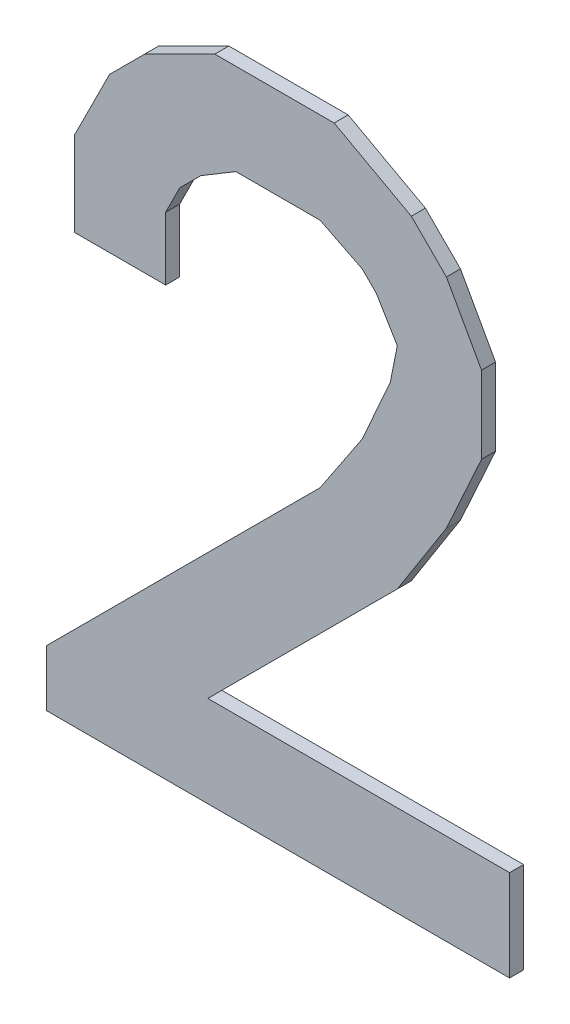
ISO-10303-21;
HEADER;
FILE_DESCRIPTION(('STEP AP214'),'2;1');
FILE_NAME('part.step','',(''),(''),'','','');
FILE_SCHEMA(('AUTOMOTIVE_DESIGN { 1 0 10303 214 1 1 1 1 }'));
ENDSEC;
DATA;
#1=APPLICATION_CONTEXT('core data for automotive mechanical design processes');
#2=APPLICATION_PROTOCOL_DEFINITION('international standard','automotive_design',2000,#1);
#3=PRODUCT_CONTEXT('',#1,'mechanical');
#4=PRODUCT('Part','Part','',(#3));
#5=PRODUCT_RELATED_PRODUCT_CATEGORY('part','',(#4));
#6=PRODUCT_DEFINITION_FORMATION('','',#4);
#7=PRODUCT_DEFINITION_CONTEXT('part definition',#1,'design');
#8=PRODUCT_DEFINITION('design','',#6,#7);
#9=PRODUCT_DEFINITION_SHAPE('','',#8);
#10=(LENGTH_UNIT() NAMED_UNIT(*) SI_UNIT(.MILLI.,.METRE.));
#11=(NAMED_UNIT(*) PLANE_ANGLE_UNIT() SI_UNIT($,.RADIAN.));
#12=(NAMED_UNIT(*) SI_UNIT($,.STERADIAN.) SOLID_ANGLE_UNIT());
#13=UNCERTAINTY_MEASURE_WITH_UNIT(LENGTH_MEASURE(1.E-05),#10,'distance_accuracy_value','');
#14=(GEOMETRIC_REPRESENTATION_CONTEXT(3) GLOBAL_UNCERTAINTY_ASSIGNED_CONTEXT((#13)) GLOBAL_UNIT_ASSIGNED_CONTEXT((#10,
#11,#12)) REPRESENTATION_CONTEXT('',''));
#15=CARTESIAN_POINT('',(0.,0.,0.));
#16=DIRECTION('',(0.,0.,1.));
#17=DIRECTION('',(1.,0.,0.));
#18=AXIS2_PLACEMENT_3D('',#15,#16,#17);
#19=CARTESIAN_POINT('',(-0.28999942,0.14500098,0.));
#20=DIRECTION('',(0.,0.,-1.));
#21=DIRECTION('',(0.,-1.,0.));
#22=AXIS2_PLACEMENT_3D('',#19,#20,#21);
#23=PLANE('',#22);
#24=DIRECTION('',(0.,-1.,0.));
#25=VECTOR('',#24,1.);
#26=CARTESIAN_POINT('',(-0.15999968,0.14500098,0.));
#27=LINE('',#26,#25);
#28=CARTESIAN_POINT('',(-0.15999968,0.2350008,0.));
#29=VERTEX_POINT('',#28);
#30=CARTESIAN_POINT('',(-0.15999968,0.14500098,0.));
#31=VERTEX_POINT('',#30);
#32=EDGE_CURVE('E27',#29,#31,#27,.T.);
#33=ORIENTED_EDGE('',*,*,#32,.T.);
#34=DIRECTION('',(-1.,0.,0.));
#35=VECTOR('',#34,1.);
#36=CARTESIAN_POINT('',(-0.28999942,0.14500098,0.));
#37=LINE('',#36,#35);
#38=CARTESIAN_POINT('',(-0.28999942,0.14500098,0.));
#39=VERTEX_POINT('',#38);
#40=EDGE_CURVE('E11',#31,#39,#37,.T.);
#41=ORIENTED_EDGE('',*,*,#40,.T.);
#42=DIRECTION('',(0.,1.,0.));
#43=VECTOR('',#42,1.);
#44=CARTESIAN_POINT('',(-0.28999942,0.14500098,0.));
#45=LINE('',#44,#43);
#46=CARTESIAN_POINT('',(-0.28999942,0.26500074,0.));
#47=VERTEX_POINT('',#46);
#48=EDGE_CURVE('E389',#39,#47,#45,.T.);
#49=ORIENTED_EDGE('',*,*,#48,.T.);
#50=DIRECTION('',(0.447213595499958,0.894427190999916,0.));
#51=VECTOR('',#50,1.);
#52=CARTESIAN_POINT('',(-0.28999942,0.26500074,0.));
#53=LINE('',#52,#51);
#54=CARTESIAN_POINT('',(-0.23999952,0.36500054,0.));
#55=VERTEX_POINT('',#54);
#56=EDGE_CURVE('E400',#47,#55,#53,.T.);
#57=ORIENTED_EDGE('',*,*,#56,.T.);
#58=DIRECTION('',(0.707106781186548,0.707106781186548,0.));
#59=VECTOR('',#58,1.);
#60=CARTESIAN_POINT('',(-0.23999952,0.36500054,0.));
#61=LINE('',#60,#59);
#62=CARTESIAN_POINT('',(-0.18999962,0.41500044,0.));
#63=VERTEX_POINT('',#62);
#64=EDGE_CURVE('E399',#55,#63,#61,.T.);
#65=ORIENTED_EDGE('',*,*,#64,.T.);
#66=DIRECTION('',(0.894427190999916,0.447213595499958,0.));
#67=VECTOR('',#66,1.);
#68=CARTESIAN_POINT('',(-0.18999962,0.41500044,0.));
#69=LINE('',#68,#67);
#70=CARTESIAN_POINT('',(-0.08999982,0.46500034,0.));
#71=VERTEX_POINT('',#70);
#72=EDGE_CURVE('E365',#63,#71,#69,.T.);
#73=ORIENTED_EDGE('',*,*,#72,.T.);
#74=DIRECTION('',(1.,0.,0.));
#75=VECTOR('',#74,1.);
#76=CARTESIAN_POINT('',(-0.28999942,0.46500034,0.));
#77=LINE('',#76,#75);
#78=CARTESIAN_POINT('',(0.07999984000001,0.46500034,0.));
#79=VERTEX_POINT('',#78);
#80=EDGE_CURVE('E431',#71,#79,#77,.T.);
#81=ORIENTED_EDGE('',*,*,#80,.T.);
#82=DIRECTION('',(0.877895572914117,-0.478852130681064,0.));
#83=VECTOR('',#82,1.);
#84=CARTESIAN_POINT('',(0.07999984,0.46500034,0.));
#85=LINE('',#84,#83);
#86=CARTESIAN_POINT('',(0.18999962,0.40500046,0.));
#87=VERTEX_POINT('',#86);
#88=EDGE_CURVE('E439',#79,#87,#85,.T.);
#89=ORIENTED_EDGE('',*,*,#88,.T.);
#90=DIRECTION('',(0.707106781186548,-0.707106781186548,0.));
#91=VECTOR('',#90,1.);
#92=CARTESIAN_POINT('',(0.18999962,0.40500046,0.));
#93=LINE('',#92,#91);
#94=CARTESIAN_POINT('',(0.23999952,0.35500056,0.));
#95=VERTEX_POINT('',#94);
#96=EDGE_CURVE('E424',#87,#95,#93,.T.);
#97=ORIENTED_EDGE('',*,*,#96,.T.);
#98=DIRECTION('',(0.485642931178717,-0.874157276121491,0.));
#99=VECTOR('',#98,1.);
#100=CARTESIAN_POINT('',(0.23999952,0.35500056,0.));
#101=LINE('',#100,#99);
#102=CARTESIAN_POINT('',(0.28999942,0.26500074,0.));
#103=VERTEX_POINT('',#102);
#104=EDGE_CURVE('E423',#95,#103,#101,.T.);
#105=ORIENTED_EDGE('',*,*,#104,.T.);
#106=DIRECTION('',(0.,-1.,0.));
#107=VECTOR('',#106,1.);
#108=CARTESIAN_POINT('',(0.28999942,0.14500098,0.));
#109=LINE('',#108,#107);
#110=CARTESIAN_POINT('',(0.28999942,0.15500096,0.));
#111=VERTEX_POINT('',#110);
#112=EDGE_CURVE('E456',#103,#111,#109,.T.);
#113=ORIENTED_EDGE('',*,*,#112,.T.);
#114=DIRECTION('',(-0.413802944300882,-0.910366477462742,0.));
#115=VECTOR('',#114,1.);
#116=CARTESIAN_POINT('',(0.28999942,0.15500096,0.));
#117=LINE('',#116,#115);
#118=CARTESIAN_POINT('',(0.23999952,0.04500118,0.));
#119=VERTEX_POINT('',#118);
#120=EDGE_CURVE('E461',#111,#119,#117,.T.);
#121=ORIENTED_EDGE('',*,*,#120,.T.);
#122=DIRECTION('',(-0.536875492193095,-0.843661487732149,0.));
#123=VECTOR('',#122,1.);
#124=CARTESIAN_POINT('',(0.23999952,0.04500118,0.));
#125=LINE('',#124,#123);
#126=CARTESIAN_POINT('',(0.16999966,-0.06499860000001,0.));
#127=VERTEX_POINT('',#126);
#128=EDGE_CURVE('E475',#119,#127,#125,.T.);
#129=ORIENTED_EDGE('',*,*,#128,.T.);
#130=DIRECTION('',(-0.707106781186548,-0.707106781186548,0.));
#131=VECTOR('',#130,1.);
#132=CARTESIAN_POINT('',(0.16999966,-0.06499860000001,0.));
#133=LINE('',#132,#131);
#134=CARTESIAN_POINT('',(-0.09999980000001,-0.33499806,0.));
#135=VERTEX_POINT('',#134);
#136=EDGE_CURVE('E476',#127,#135,#133,.T.);
#137=ORIENTED_EDGE('',*,*,#136,.T.);
#138=DIRECTION('',(1.,0.,0.));
#139=VECTOR('',#138,1.);
#140=CARTESIAN_POINT('',(-0.28999942,-0.33499806,0.));
#141=LINE('',#140,#139);
#142=CARTESIAN_POINT('',(0.32999934,-0.33499806,0.));
#143=VERTEX_POINT('',#142);
#144=EDGE_CURVE('E482',#135,#143,#141,.T.);
#145=ORIENTED_EDGE('',*,*,#144,.T.);
#146=DIRECTION('',(0.,-1.,0.));
#147=VECTOR('',#146,1.);
#148=CARTESIAN_POINT('',(0.32999934,0.14500098,0.));
#149=LINE('',#148,#147);
#150=CARTESIAN_POINT('',(0.32999934,-0.4649978,0.));
#151=VERTEX_POINT('',#150);
#152=EDGE_CURVE('E490',#143,#151,#149,.T.);
#153=ORIENTED_EDGE('',*,*,#152,.T.);
#154=DIRECTION('',(-1.,0.,0.));
#155=VECTOR('',#154,1.);
#156=CARTESIAN_POINT('',(-0.28999942,-0.4649978,0.));
#157=LINE('',#156,#155);
#158=CARTESIAN_POINT('',(-0.32999934,-0.4649978,0.));
#159=VERTEX_POINT('',#158);
#160=EDGE_CURVE('E495',#151,#159,#157,.T.);
#161=ORIENTED_EDGE('',*,*,#160,.T.);
#162=DIRECTION('',(0.,1.,0.));
#163=VECTOR('',#162,1.);
#164=CARTESIAN_POINT('',(-0.32999934,0.14500098,0.));
#165=LINE('',#164,#163);
#166=CARTESIAN_POINT('',(-0.32999934,-0.38499796,0.));
#167=VERTEX_POINT('',#166);
#168=EDGE_CURVE('E285',#159,#167,#165,.T.);
#169=ORIENTED_EDGE('',*,*,#168,.T.);
#170=DIRECTION('',(0.707106781186548,0.707106781186548,0.));
#171=VECTOR('',#170,1.);
#172=CARTESIAN_POINT('',(-0.32999934,-0.38499796,0.));
#173=LINE('',#172,#171);
#174=CARTESIAN_POINT('',(0.05999988,0.005001259999995,0.));
#175=VERTEX_POINT('',#174);
#176=EDGE_CURVE('E284',#167,#175,#173,.T.);
#177=ORIENTED_EDGE('',*,*,#176,.T.);
#178=DIRECTION('',(0.554700196224998,0.832050294337998,0.));
#179=VECTOR('',#178,1.);
#180=CARTESIAN_POINT('',(0.05999987999999,0.00500126,0.));
#181=LINE('',#180,#179);
#182=CARTESIAN_POINT('',(0.11999976,0.09500108,0.));
#183=VERTEX_POINT('',#182);
#184=EDGE_CURVE('E280',#175,#183,#181,.T.);
#185=ORIENTED_EDGE('',*,*,#184,.T.);
#186=DIRECTION('',(0.40613846605317,0.913811548620381,0.));
#187=VECTOR('',#186,1.);
#188=CARTESIAN_POINT('',(0.11999976,0.09500108,0.));
#189=LINE('',#188,#187);
#190=CARTESIAN_POINT('',(0.15999968,0.1850009,0.));
#191=VERTEX_POINT('',#190);
#192=EDGE_CURVE('E418',#183,#191,#189,.T.);
#193=ORIENTED_EDGE('',*,*,#192,.T.);
#194=DIRECTION('',(0.196116135137992,0.980580675690959,0.));
#195=VECTOR('',#194,1.);
#196=CARTESIAN_POINT('',(0.15999968,0.1850009,0.));
#197=LINE('',#196,#195);
#198=CARTESIAN_POINT('',(0.16999966,0.2350008,0.));
#199=VERTEX_POINT('',#198);
#200=EDGE_CURVE('E508',#191,#199,#197,.T.);
#201=ORIENTED_EDGE('',*,*,#200,.T.);
#202=DIRECTION('',(-0.514495755427674,0.857492925712456,0.));
#203=VECTOR('',#202,1.);
#204=CARTESIAN_POINT('',(0.16999966,0.2350008,0.));
#205=LINE('',#204,#203);
#206=CARTESIAN_POINT('',(0.13999972,0.2850007,0.));
#207=VERTEX_POINT('',#206);
#208=EDGE_CURVE('E507',#199,#207,#205,.T.);
#209=ORIENTED_EDGE('',*,*,#208,.T.);
#210=DIRECTION('',(-0.707106781186548,0.707106781186548,0.));
#211=VECTOR('',#210,1.);
#212=CARTESIAN_POINT('',(0.13999972,0.2850007,0.));
#213=LINE('',#212,#211);
#214=CARTESIAN_POINT('',(0.11999976,0.30500066,0.));
#215=VERTEX_POINT('',#214);
#216=EDGE_CURVE('E462',#207,#215,#213,.T.);
#217=ORIENTED_EDGE('',*,*,#216,.T.);
#218=DIRECTION('',(-0.894427190999916,0.447213595499958,0.));
#219=VECTOR('',#218,1.);
#220=CARTESIAN_POINT('',(0.11999976,0.30500066,0.));
#221=LINE('',#220,#219);
#222=CARTESIAN_POINT('',(0.05999987999999,0.3350006,0.));
#223=VERTEX_POINT('',#222);
#224=EDGE_CURVE('E524',#215,#223,#221,.T.);
#225=ORIENTED_EDGE('',*,*,#224,.T.);
#226=DIRECTION('',(-1.,0.,0.));
#227=VECTOR('',#226,1.);
#228=CARTESIAN_POINT('',(-0.28999942,0.3350006,0.));
#229=LINE('',#228,#227);
#230=CARTESIAN_POINT('',(-0.05999988000001,0.3350006,0.));
#231=VERTEX_POINT('',#230);
#232=EDGE_CURVE('E377',#223,#231,#229,.T.);
#233=ORIENTED_EDGE('',*,*,#232,.T.);
#234=DIRECTION('',(-0.857492925712191,-0.514495755428115,0.));
#235=VECTOR('',#234,1.);
#236=CARTESIAN_POINT('',(-0.05999988000001,0.3350006,0.));
#237=LINE('',#236,#235);
#238=CARTESIAN_POINT('',(-0.10999978,0.30500066,0.));
#239=VERTEX_POINT('',#238);
#240=EDGE_CURVE('E533',#231,#239,#237,.T.);
#241=ORIENTED_EDGE('',*,*,#240,.T.);
#242=DIRECTION('',(-0.707106781186548,-0.707106781186548,0.));
#243=VECTOR('',#242,1.);
#244=CARTESIAN_POINT('',(-0.10999978,0.30500066,0.));
#245=LINE('',#244,#243);
#246=CARTESIAN_POINT('',(-0.13999972,0.27500072,0.));
#247=VERTEX_POINT('',#246);
#248=EDGE_CURVE('E542',#239,#247,#245,.T.);
#249=ORIENTED_EDGE('',*,*,#248,.T.);
#250=DIRECTION('',(-0.447213595499958,-0.894427190999916,0.));
#251=VECTOR('',#250,1.);
#252=CARTESIAN_POINT('',(-0.13999972,0.27500072,0.));
#253=LINE('',#252,#251);
#254=EDGE_CURVE('E390',#247,#29,#253,.T.);
#255=ORIENTED_EDGE('',*,*,#254,.T.);
#256=EDGE_LOOP('',(#33,#41,#49,#57,#65,#73,#81,#89,#97,#105,#113,#121,#129,#137,#145,#153,#161,
#169,#177,#185,#193,#201,#209,#217,#225,#233,#241,#249,#255));
#257=FACE_BOUND('',#256,.T.);
#258=ADVANCED_FACE('F17',(#257),#23,.T.);
#259=CARTESIAN_POINT('',(-0.28999942,0.14500098,0.));
#260=DIRECTION('',(0.,1.,0.));
#261=DIRECTION('',(1.,0.,0.));
#262=AXIS2_PLACEMENT_3D('',#259,#260,#261);
#263=PLANE('',#262);
#264=DIRECTION('',(0.,0.,-1.));
#265=VECTOR('',#264,1.);
#266=CARTESIAN_POINT('',(-0.15999968,0.14500098,0.));
#267=LINE('',#266,#265);
#268=CARTESIAN_POINT('',(-0.15999968,0.14500098,0.02));
#269=VERTEX_POINT('',#268);
#270=EDGE_CURVE('E393',#269,#31,#267,.T.);
#271=ORIENTED_EDGE('',*,*,#270,.F.);
#272=DIRECTION('',(1.,0.,0.));
#273=VECTOR('',#272,1.);
#274=CARTESIAN_POINT('',(-0.28999942,0.14500098,0.02));
#275=LINE('',#274,#273);
#276=CARTESIAN_POINT('',(-0.28999942,0.14500098,0.02));
#277=VERTEX_POINT('',#276);
#278=EDGE_CURVE('E343',#277,#269,#275,.T.);
#279=ORIENTED_EDGE('',*,*,#278,.F.);
#280=DIRECTION('',(0.,0.,1.));
#281=VECTOR('',#280,1.);
#282=CARTESIAN_POINT('',(-0.28999942,0.14500098,0.));
#283=LINE('',#282,#281);
#284=EDGE_CURVE('E347',#39,#277,#283,.T.);
#285=ORIENTED_EDGE('',*,*,#284,.F.);
#286=ORIENTED_EDGE('',*,*,#40,.F.);
#287=EDGE_LOOP('',(#271,#279,#285,#286));
#288=FACE_BOUND('',#287,.T.);
#289=ADVANCED_FACE('F19',(#288),#263,.F.);
#290=CARTESIAN_POINT('',(-0.15999968,0.14500098,0.));
#291=DIRECTION('',(-1.,0.,0.));
#292=DIRECTION('',(0.,0.,1.));
#293=AXIS2_PLACEMENT_3D('',#290,#291,#292);
#294=PLANE('',#293);
#295=DIRECTION('',(0.,0.,-1.));
#296=VECTOR('',#295,1.);
#297=CARTESIAN_POINT('',(-0.15999968,0.2350008,0.));
#298=LINE('',#297,#296);
#299=CARTESIAN_POINT('',(-0.15999968,0.2350008,0.02));
#300=VERTEX_POINT('',#299);
#301=EDGE_CURVE('E394',#300,#29,#298,.T.);
#302=ORIENTED_EDGE('',*,*,#301,.F.);
#303=DIRECTION('',(0.,1.,0.));
#304=VECTOR('',#303,1.);
#305=CARTESIAN_POINT('',(-0.15999968,0.14500098,0.02));
#306=LINE('',#305,#304);
#307=EDGE_CURVE('E620',#269,#300,#306,.T.);
#308=ORIENTED_EDGE('',*,*,#307,.F.);
#309=ORIENTED_EDGE('',*,*,#270,.T.);
#310=ORIENTED_EDGE('',*,*,#32,.F.);
#311=EDGE_LOOP('',(#302,#308,#309,#310));
#312=FACE_BOUND('',#311,.T.);
#313=ADVANCED_FACE('F1086',(#312),#294,.F.);
#314=CARTESIAN_POINT('',(-0.15999968,0.2350008,0.));
#315=DIRECTION('',(-0.894427190999916,0.447213595499958,0.));
#316=DIRECTION('',(0.,0.,1.));
#317=AXIS2_PLACEMENT_3D('',#314,#315,#316);
#318=PLANE('',#317);
#319=DIRECTION('',(0.,0.,-1.));
#320=VECTOR('',#319,1.);
#321=CARTESIAN_POINT('',(-0.13999972,0.27500072,0.));
#322=LINE('',#321,#320);
#323=CARTESIAN_POINT('',(-0.13999972,0.27500072,0.02));
#324=VERTEX_POINT('',#323);
#325=EDGE_CURVE('E21',#324,#247,#322,.T.);
#326=ORIENTED_EDGE('',*,*,#325,.F.);
#327=DIRECTION('',(0.447213595499958,0.894427190999916,0.));
#328=VECTOR('',#327,1.);
#329=CARTESIAN_POINT('',(-0.15999968,0.2350008,0.02));
#330=LINE('',#329,#328);
#331=EDGE_CURVE('E610',#300,#324,#330,.T.);
#332=ORIENTED_EDGE('',*,*,#331,.F.);
#333=ORIENTED_EDGE('',*,*,#301,.T.);
#334=ORIENTED_EDGE('',*,*,#254,.F.);
#335=EDGE_LOOP('',(#326,#332,#333,#334));
#336=FACE_BOUND('',#335,.T.);
#337=ADVANCED_FACE('F921',(#336),#318,.F.);
#338=CARTESIAN_POINT('',(-0.13999972,0.27500072,0.));
#339=DIRECTION('',(-0.707106781186548,0.707106781186548,0.));
#340=DIRECTION('',(0.,0.,1.));
#341=AXIS2_PLACEMENT_3D('',#338,#339,#340);
#342=PLANE('',#341);
#343=DIRECTION('',(0.,0.,-1.));
#344=VECTOR('',#343,1.);
#345=CARTESIAN_POINT('',(-0.10999978,0.30500066,0.));
#346=LINE('',#345,#344);
#347=CARTESIAN_POINT('',(-0.10999978,0.30500066,0.02));
#348=VERTEX_POINT('',#347);
#349=EDGE_CURVE('E381',#348,#239,#346,.T.);
#350=ORIENTED_EDGE('',*,*,#349,.F.);
#351=DIRECTION('',(0.707106781186548,0.707106781186548,0.));
#352=VECTOR('',#351,1.);
#353=CARTESIAN_POINT('',(-0.13999972,0.27500072,0.02));
#354=LINE('',#353,#352);
#355=EDGE_CURVE('E596',#324,#348,#354,.T.);
#356=ORIENTED_EDGE('',*,*,#355,.F.);
#357=ORIENTED_EDGE('',*,*,#325,.T.);
#358=ORIENTED_EDGE('',*,*,#248,.F.);
#359=EDGE_LOOP('',(#350,#356,#357,#358));
#360=FACE_BOUND('',#359,.T.);
#361=ADVANCED_FACE('F915',(#360),#342,.F.);
#362=CARTESIAN_POINT('',(-0.10999978,0.30500066,0.));
#363=DIRECTION('',(-0.514495755428115,0.857492925712191,0.));
#364=DIRECTION('',(0.,0.,1.));
#365=AXIS2_PLACEMENT_3D('',#362,#363,#364);
#366=PLANE('',#365);
#367=DIRECTION('',(0.,0.,-1.));
#368=VECTOR('',#367,1.);
#369=CARTESIAN_POINT('',(-0.05999988000003,0.3350006,0.));
#370=LINE('',#369,#368);
#371=CARTESIAN_POINT('',(-0.05999988000001,0.3350006,0.02));
#372=VERTEX_POINT('',#371);
#373=EDGE_CURVE('E382',#372,#231,#370,.T.);
#374=ORIENTED_EDGE('',*,*,#373,.F.);
#375=DIRECTION('',(0.857492925712191,0.514495755428115,0.));
#376=VECTOR('',#375,1.);
#377=CARTESIAN_POINT('',(-0.10999978,0.30500066,0.02));
#378=LINE('',#377,#376);
#379=EDGE_CURVE('E583',#348,#372,#378,.T.);
#380=ORIENTED_EDGE('',*,*,#379,.F.);
#381=ORIENTED_EDGE('',*,*,#349,.T.);
#382=ORIENTED_EDGE('',*,*,#240,.F.);
#383=EDGE_LOOP('',(#374,#380,#381,#382));
#384=FACE_BOUND('',#383,.T.);
#385=ADVANCED_FACE('F920',(#384),#366,.F.);
#386=CARTESIAN_POINT('',(-0.05999988000001,0.3350006,0.));
#387=DIRECTION('',(0.,1.,0.));
#388=DIRECTION('',(1.,0.,0.));
#389=AXIS2_PLACEMENT_3D('',#386,#387,#388);
#390=PLANE('',#389);
#391=DIRECTION('',(0.,0.,-1.));
#392=VECTOR('',#391,1.);
#393=CARTESIAN_POINT('',(0.05999987999999,0.3350006,0.));
#394=LINE('',#393,#392);
#395=CARTESIAN_POINT('',(0.05999987999999,0.3350006,0.02));
#396=VERTEX_POINT('',#395);
#397=EDGE_CURVE('E466',#396,#223,#394,.T.);
#398=ORIENTED_EDGE('',*,*,#397,.F.);
#399=DIRECTION('',(1.,0.,0.));
#400=VECTOR('',#399,1.);
#401=CARTESIAN_POINT('',(-0.05999988000001,0.3350006,0.02));
#402=LINE('',#401,#400);
#403=EDGE_CURVE('E578',#372,#396,#402,.T.);
#404=ORIENTED_EDGE('',*,*,#403,.F.);
#405=ORIENTED_EDGE('',*,*,#373,.T.);
#406=ORIENTED_EDGE('',*,*,#232,.F.);
#407=EDGE_LOOP('',(#398,#404,#405,#406));
#408=FACE_BOUND('',#407,.T.);
#409=ADVANCED_FACE('F976',(#408),#390,.F.);
#410=CARTESIAN_POINT('',(0.05999987999999,0.3350006,0.));
#411=DIRECTION('',(0.447213595499958,0.894427190999916,0.));
#412=DIRECTION('',(0.,0.,-1.));
#413=AXIS2_PLACEMENT_3D('',#410,#411,#412);
#414=PLANE('',#413);
#415=DIRECTION('',(0.,0.,-1.));
#416=VECTOR('',#415,1.);
#417=CARTESIAN_POINT('',(0.11999976,0.30500066,0.));
#418=LINE('',#417,#416);
#419=CARTESIAN_POINT('',(0.11999976,0.30500066,0.02));
#420=VERTEX_POINT('',#419);
#421=EDGE_CURVE('E467',#420,#215,#418,.T.);
#422=ORIENTED_EDGE('',*,*,#421,.F.);
#423=DIRECTION('',(0.894427190999916,-0.447213595499958,0.));
#424=VECTOR('',#423,1.);
#425=CARTESIAN_POINT('',(0.05999987999999,0.3350006,0.02));
#426=LINE('',#425,#424);
#427=EDGE_CURVE('E582',#396,#420,#426,.T.);
#428=ORIENTED_EDGE('',*,*,#427,.F.);
#429=ORIENTED_EDGE('',*,*,#397,.T.);
#430=ORIENTED_EDGE('',*,*,#224,.F.);
#431=EDGE_LOOP('',(#422,#428,#429,#430));
#432=FACE_BOUND('',#431,.T.);
#433=ADVANCED_FACE('F981',(#432),#414,.F.);
#434=CARTESIAN_POINT('',(0.11999976,0.30500066,0.));
#435=DIRECTION('',(0.707106781186548,0.707106781186548,0.));
#436=DIRECTION('',(0.,0.,-1.));
#437=AXIS2_PLACEMENT_3D('',#434,#435,#436);
#438=PLANE('',#437);
#439=DIRECTION('',(0.,0.,-1.));
#440=VECTOR('',#439,1.);
#441=CARTESIAN_POINT('',(0.13999972,0.2850007,0.));
#442=LINE('',#441,#440);
#443=CARTESIAN_POINT('',(0.13999972,0.2850007,0.02));
#444=VERTEX_POINT('',#443);
#445=EDGE_CURVE('E503',#444,#207,#442,.T.);
#446=ORIENTED_EDGE('',*,*,#445,.F.);
#447=DIRECTION('',(0.707106781186548,-0.707106781186548,0.));
#448=VECTOR('',#447,1.);
#449=CARTESIAN_POINT('',(0.11999976,0.30500066,0.02));
#450=LINE('',#449,#448);
#451=EDGE_CURVE('E571',#420,#444,#450,.T.);
#452=ORIENTED_EDGE('',*,*,#451,.F.);
#453=ORIENTED_EDGE('',*,*,#421,.T.);
#454=ORIENTED_EDGE('',*,*,#216,.F.);
#455=EDGE_LOOP('',(#446,#452,#453,#454));
#456=FACE_BOUND('',#455,.T.);
#457=ADVANCED_FACE('F631',(#456),#438,.F.);
#458=CARTESIAN_POINT('',(0.13999972,0.2850007,0.));
#459=DIRECTION('',(0.857492925712897,0.514495755426938,0.));
#460=DIRECTION('',(0.,0.,-1.));
#461=AXIS2_PLACEMENT_3D('',#458,#459,#460);
#462=PLANE('',#461);
#463=DIRECTION('',(0.,0.,-1.));
#464=VECTOR('',#463,1.);
#465=CARTESIAN_POINT('',(0.16999966,0.2350008,0.));
#466=LINE('',#465,#464);
#467=CARTESIAN_POINT('',(0.16999966,0.2350008,0.02));
#468=VERTEX_POINT('',#467);
#469=EDGE_CURVE('E514',#468,#199,#466,.T.);
#470=ORIENTED_EDGE('',*,*,#469,.F.);
#471=DIRECTION('',(0.514495755426938,-0.857492925712897,0.));
#472=VECTOR('',#471,1.);
#473=CARTESIAN_POINT('',(0.13999972,0.2850007,0.02));
#474=LINE('',#473,#472);
#475=EDGE_CURVE('E556',#444,#468,#474,.T.);
#476=ORIENTED_EDGE('',*,*,#475,.F.);
#477=ORIENTED_EDGE('',*,*,#445,.T.);
#478=ORIENTED_EDGE('',*,*,#208,.F.);
#479=EDGE_LOOP('',(#470,#476,#477,#478));
#480=FACE_BOUND('',#479,.T.);
#481=ADVANCED_FACE('F633',(#480),#462,.F.);
#482=CARTESIAN_POINT('',(0.16999966,0.2350008,0.));
#483=DIRECTION('',(0.980580675690959,-0.196116135137992,0.));
#484=DIRECTION('',(0.,0.,-1.));
#485=AXIS2_PLACEMENT_3D('',#482,#483,#484);
#486=PLANE('',#485);
#487=DIRECTION('',(0.,0.,-1.));
#488=VECTOR('',#487,1.);
#489=CARTESIAN_POINT('',(0.15999968,0.1850009,0.));
#490=LINE('',#489,#488);
#491=CARTESIAN_POINT('',(0.15999968,0.1850009,0.02));
#492=VERTEX_POINT('',#491);
#493=EDGE_CURVE('E414',#492,#191,#490,.T.);
#494=ORIENTED_EDGE('',*,*,#493,.F.);
#495=DIRECTION('',(-0.196116135137992,-0.980580675690959,0.));
#496=VECTOR('',#495,1.);
#497=CARTESIAN_POINT('',(0.16999966,0.2350008,0.02));
#498=LINE('',#497,#496);
#499=EDGE_CURVE('E309',#468,#492,#498,.T.);
#500=ORIENTED_EDGE('',*,*,#499,.F.);
#501=ORIENTED_EDGE('',*,*,#469,.T.);
#502=ORIENTED_EDGE('',*,*,#200,.F.);
#503=EDGE_LOOP('',(#494,#500,#501,#502));
#504=FACE_BOUND('',#503,.T.);
#505=ADVANCED_FACE('F636',(#504),#486,.F.);
#506=CARTESIAN_POINT('',(0.15999968,0.1850009,0.));
#507=DIRECTION('',(0.913811548620381,-0.40613846605317,0.));
#508=DIRECTION('',(0.,0.,-1.));
#509=AXIS2_PLACEMENT_3D('',#506,#507,#508);
#510=PLANE('',#509);
#511=DIRECTION('',(0.,0.,-1.));
#512=VECTOR('',#511,1.);
#513=CARTESIAN_POINT('',(0.11999976,0.09500107999999,0.));
#514=LINE('',#513,#512);
#515=CARTESIAN_POINT('',(0.11999976,0.09500108,0.02));
#516=VERTEX_POINT('',#515);
#517=EDGE_CURVE('E320',#516,#183,#514,.T.);
#518=ORIENTED_EDGE('',*,*,#517,.F.);
#519=DIRECTION('',(-0.40613846605317,-0.913811548620381,0.));
#520=VECTOR('',#519,1.);
#521=CARTESIAN_POINT('',(0.15999968,0.1850009,0.02));
#522=LINE('',#521,#520);
#523=EDGE_CURVE('E302',#492,#516,#522,.T.);
#524=ORIENTED_EDGE('',*,*,#523,.F.);
#525=ORIENTED_EDGE('',*,*,#493,.T.);
#526=ORIENTED_EDGE('',*,*,#192,.F.);
#527=EDGE_LOOP('',(#518,#524,#525,#526));
#528=FACE_BOUND('',#527,.T.);
#529=ADVANCED_FACE('F638',(#528),#510,.F.);
#530=CARTESIAN_POINT('',(0.11999976,0.09500108,0.));
#531=DIRECTION('',(0.832050294337998,-0.554700196224998,0.));
#532=DIRECTION('',(0.,0.,-1.));
#533=AXIS2_PLACEMENT_3D('',#530,#531,#532);
#534=PLANE('',#533);
#535=DIRECTION('',(0.,0.,-1.));
#536=VECTOR('',#535,1.);
#537=CARTESIAN_POINT('',(0.05999988000002,0.005001259999979,0.));
#538=LINE('',#537,#536);
#539=CARTESIAN_POINT('',(0.05999988,0.005001259999995,0.02));
#540=VERTEX_POINT('',#539);
#541=EDGE_CURVE('E272',#540,#175,#538,.T.);
#542=ORIENTED_EDGE('',*,*,#541,.F.);
#543=DIRECTION('',(-0.554700196224998,-0.832050294337998,0.));
#544=VECTOR('',#543,1.);
#545=CARTESIAN_POINT('',(0.11999976,0.09500108,0.02));
#546=LINE('',#545,#544);
#547=EDGE_CURVE('E277',#516,#540,#546,.T.);
#548=ORIENTED_EDGE('',*,*,#547,.F.);
#549=ORIENTED_EDGE('',*,*,#517,.T.);
#550=ORIENTED_EDGE('',*,*,#184,.F.);
#551=EDGE_LOOP('',(#542,#548,#549,#550));
#552=FACE_BOUND('',#551,.T.);
#553=ADVANCED_FACE('F274',(#552),#534,.F.);
#554=CARTESIAN_POINT('',(0.05999987999999,0.00500126,0.));
#555=DIRECTION('',(0.707106781186548,-0.707106781186548,0.));
#556=DIRECTION('',(0.,0.,-1.));
#557=AXIS2_PLACEMENT_3D('',#554,#555,#556);
#558=PLANE('',#557);
#559=DIRECTION('',(0.,0.,-1.));
#560=VECTOR('',#559,1.);
#561=CARTESIAN_POINT('',(-0.32999934,-0.38499796,0.));
#562=LINE('',#561,#560);
#563=CARTESIAN_POINT('',(-0.32999934,-0.38499796,0.02));
#564=VERTEX_POINT('',#563);
#565=EDGE_CURVE('E291',#564,#167,#562,.T.);
#566=ORIENTED_EDGE('',*,*,#565,.F.);
#567=DIRECTION('',(-0.707106781186548,-0.707106781186548,0.));
#568=VECTOR('',#567,1.);
#569=CARTESIAN_POINT('',(0.05999987999999,0.00500126,0.02));
#570=LINE('',#569,#568);
#571=EDGE_CURVE('E288',#540,#564,#570,.T.);
#572=ORIENTED_EDGE('',*,*,#571,.F.);
#573=ORIENTED_EDGE('',*,*,#541,.T.);
#574=ORIENTED_EDGE('',*,*,#176,.F.);
#575=EDGE_LOOP('',(#566,#572,#573,#574));
#576=FACE_BOUND('',#575,.T.);
#577=ADVANCED_FACE('F289',(#576),#558,.F.);
#578=CARTESIAN_POINT('',(-0.32999934,-0.38499796,0.));
#579=DIRECTION('',(1.,0.,0.));
#580=DIRECTION('',(0.,1.,0.));
#581=AXIS2_PLACEMENT_3D('',#578,#579,#580);
#582=PLANE('',#581);
#583=DIRECTION('',(0.,0.,-1.));
#584=VECTOR('',#583,1.);
#585=CARTESIAN_POINT('',(-0.32999934,-0.4649978,0.));
#586=LINE('',#585,#584);
#587=CARTESIAN_POINT('',(-0.32999934,-0.4649978,0.02));
#588=VERTEX_POINT('',#587);
#589=EDGE_CURVE('E491',#588,#159,#586,.T.);
#590=ORIENTED_EDGE('',*,*,#589,.F.);
#591=DIRECTION('',(0.,-1.,0.));
#592=VECTOR('',#591,1.);
#593=CARTESIAN_POINT('',(-0.32999934,-0.38499796,0.02));
#594=LINE('',#593,#592);
#595=EDGE_CURVE('E296',#564,#588,#594,.T.);
#596=ORIENTED_EDGE('',*,*,#595,.F.);
#597=ORIENTED_EDGE('',*,*,#565,.T.);
#598=ORIENTED_EDGE('',*,*,#168,.F.);
#599=EDGE_LOOP('',(#590,#596,#597,#598));
#600=FACE_BOUND('',#599,.T.);
#601=ADVANCED_FACE('F640',(#600),#582,.F.);
#602=CARTESIAN_POINT('',(-0.32999934,-0.4649978,0.));
#603=DIRECTION('',(0.,1.,0.));
#604=DIRECTION('',(1.,0.,0.));
#605=AXIS2_PLACEMENT_3D('',#602,#603,#604);
#606=PLANE('',#605);
#607=DIRECTION('',(0.,0.,-1.));
#608=VECTOR('',#607,1.);
#609=CARTESIAN_POINT('',(0.32999934,-0.4649978,0.));
#610=LINE('',#609,#608);
#611=CARTESIAN_POINT('',(0.32999934,-0.4649978,0.02));
#612=VERTEX_POINT('',#611);
#613=EDGE_CURVE('E486',#612,#151,#610,.T.);
#614=ORIENTED_EDGE('',*,*,#613,.F.);
#615=DIRECTION('',(1.,0.,0.));
#616=VECTOR('',#615,1.);
#617=CARTESIAN_POINT('',(-0.32999934,-0.4649978,0.02));
#618=LINE('',#617,#616);
#619=EDGE_CURVE('E564',#588,#612,#618,.T.);
#620=ORIENTED_EDGE('',*,*,#619,.F.);
#621=ORIENTED_EDGE('',*,*,#589,.T.);
#622=ORIENTED_EDGE('',*,*,#160,.F.);
#623=EDGE_LOOP('',(#614,#620,#621,#622));
#624=FACE_BOUND('',#623,.T.);
#625=ADVANCED_FACE('F645',(#624),#606,.F.);
#626=CARTESIAN_POINT('',(0.32999934,-0.4649978,0.));
#627=DIRECTION('',(-1.,0.,0.));
#628=DIRECTION('',(0.,0.,1.));
#629=AXIS2_PLACEMENT_3D('',#626,#627,#628);
#630=PLANE('',#629);
#631=DIRECTION('',(0.,0.,-1.));
#632=VECTOR('',#631,1.);
#633=CARTESIAN_POINT('',(0.32999934,-0.33499806,0.));
#634=LINE('',#633,#632);
#635=CARTESIAN_POINT('',(0.32999934,-0.33499806,0.02));
#636=VERTEX_POINT('',#635);
#637=EDGE_CURVE('E480',#636,#143,#634,.T.);
#638=ORIENTED_EDGE('',*,*,#637,.F.);
#639=DIRECTION('',(0.,1.,0.));
#640=VECTOR('',#639,1.);
#641=CARTESIAN_POINT('',(0.32999934,-0.4649978,0.02));
#642=LINE('',#641,#640);
#643=EDGE_CURVE('E560',#612,#636,#642,.T.);
#644=ORIENTED_EDGE('',*,*,#643,.F.);
#645=ORIENTED_EDGE('',*,*,#613,.T.);
#646=ORIENTED_EDGE('',*,*,#152,.F.);
#647=EDGE_LOOP('',(#638,#644,#645,#646));
#648=FACE_BOUND('',#647,.T.);
#649=ADVANCED_FACE('F647',(#648),#630,.F.);
#650=CARTESIAN_POINT('',(0.32999934,-0.33499806,0.));
#651=DIRECTION('',(0.,-1.,0.));
#652=DIRECTION('',(0.,0.,-1.));
#653=AXIS2_PLACEMENT_3D('',#650,#651,#652);
#654=PLANE('',#653);
#655=DIRECTION('',(0.,0.,-1.));
#656=VECTOR('',#655,1.);
#657=CARTESIAN_POINT('',(-0.09999980000001,-0.33499806,0.));
#658=LINE('',#657,#656);
#659=CARTESIAN_POINT('',(-0.09999980000001,-0.33499806,0.02));
#660=VERTEX_POINT('',#659);
#661=EDGE_CURVE('E481',#660,#135,#658,.T.);
#662=ORIENTED_EDGE('',*,*,#661,.F.);
#663=DIRECTION('',(-1.,0.,0.));
#664=VECTOR('',#663,1.);
#665=CARTESIAN_POINT('',(0.32999934,-0.33499806,0.02));
#666=LINE('',#665,#664);
#667=EDGE_CURVE('E312',#636,#660,#666,.T.);
#668=ORIENTED_EDGE('',*,*,#667,.F.);
#669=ORIENTED_EDGE('',*,*,#637,.T.);
#670=ORIENTED_EDGE('',*,*,#144,.F.);
#671=EDGE_LOOP('',(#662,#668,#669,#670));
#672=FACE_BOUND('',#671,.T.);
#673=ADVANCED_FACE('F650',(#672),#654,.F.);
#674=CARTESIAN_POINT('',(-0.09999980000001,-0.33499806,0.));
#675=DIRECTION('',(-0.707106781186548,0.707106781186548,0.));
#676=DIRECTION('',(0.,0.,1.));
#677=AXIS2_PLACEMENT_3D('',#674,#675,#676);
#678=PLANE('',#677);
#679=DIRECTION('',(0.,0.,-1.));
#680=VECTOR('',#679,1.);
#681=CARTESIAN_POINT('',(0.16999966,-0.0649986,0.));
#682=LINE('',#681,#680);
#683=CARTESIAN_POINT('',(0.16999966,-0.06499860000001,0.02));
#684=VERTEX_POINT('',#683);
#685=EDGE_CURVE('E471',#684,#127,#682,.T.);
#686=ORIENTED_EDGE('',*,*,#685,.F.);
#687=DIRECTION('',(0.707106781186548,0.707106781186548,0.));
#688=VECTOR('',#687,1.);
#689=CARTESIAN_POINT('',(-0.09999980000001,-0.33499806,0.02));
#690=LINE('',#689,#688);
#691=EDGE_CURVE('E315',#660,#684,#690,.T.);
#692=ORIENTED_EDGE('',*,*,#691,.F.);
#693=ORIENTED_EDGE('',*,*,#661,.T.);
#694=ORIENTED_EDGE('',*,*,#136,.F.);
#695=EDGE_LOOP('',(#686,#692,#693,#694));
#696=FACE_BOUND('',#695,.T.);
#697=ADVANCED_FACE('F963',(#696),#678,.F.);
#698=CARTESIAN_POINT('',(0.16999966,-0.06499860000001,0.));
#699=DIRECTION('',(-0.843661487732149,0.536875492193095,0.));
#700=DIRECTION('',(0.,0.,1.));
#701=AXIS2_PLACEMENT_3D('',#698,#699,#700);
#702=PLANE('',#701);
#703=DIRECTION('',(0.,0.,-1.));
#704=VECTOR('',#703,1.);
#705=CARTESIAN_POINT('',(0.23999952,0.04500118,0.));
#706=LINE('',#705,#704);
#707=CARTESIAN_POINT('',(0.23999952,0.04500118,0.02));
#708=VERTEX_POINT('',#707);
#709=EDGE_CURVE('E457',#708,#119,#706,.T.);
#710=ORIENTED_EDGE('',*,*,#709,.F.);
#711=DIRECTION('',(0.536875492193095,0.843661487732149,0.));
#712=VECTOR('',#711,1.);
#713=CARTESIAN_POINT('',(0.16999966,-0.06499860000001,0.02));
#714=LINE('',#713,#712);
#715=EDGE_CURVE('E319',#684,#708,#714,.T.);
#716=ORIENTED_EDGE('',*,*,#715,.F.);
#717=ORIENTED_EDGE('',*,*,#685,.T.);
#718=ORIENTED_EDGE('',*,*,#128,.F.);
#719=EDGE_LOOP('',(#710,#716,#717,#718));
#720=FACE_BOUND('',#719,.T.);
#721=ADVANCED_FACE('F890',(#720),#702,.F.);
#722=CARTESIAN_POINT('',(0.23999952,0.04500118,0.));
#723=DIRECTION('',(-0.910366477462742,0.413802944300882,0.));
#724=DIRECTION('',(0.,0.,1.));
#725=AXIS2_PLACEMENT_3D('',#722,#723,#724);
#726=PLANE('',#725);
#727=DIRECTION('',(0.,0.,-1.));
#728=VECTOR('',#727,1.);
#729=CARTESIAN_POINT('',(0.28999942,0.15500096,0.));
#730=LINE('',#729,#728);
#731=CARTESIAN_POINT('',(0.28999942,0.15500096,0.02));
#732=VERTEX_POINT('',#731);
#733=EDGE_CURVE('E450',#732,#111,#730,.T.);
#734=ORIENTED_EDGE('',*,*,#733,.F.);
#735=DIRECTION('',(0.413802944300882,0.910366477462742,0.));
#736=VECTOR('',#735,1.);
#737=CARTESIAN_POINT('',(0.23999952,0.04500118,0.02));
#738=LINE('',#737,#736);
#739=EDGE_CURVE('E326',#708,#732,#738,.T.);
#740=ORIENTED_EDGE('',*,*,#739,.F.);
#741=ORIENTED_EDGE('',*,*,#709,.T.);
#742=ORIENTED_EDGE('',*,*,#120,.F.);
#743=EDGE_LOOP('',(#734,#740,#741,#742));
#744=FACE_BOUND('',#743,.T.);
#745=ADVANCED_FACE('F884',(#744),#726,.F.);
#746=CARTESIAN_POINT('',(0.28999942,0.15500096,0.));
#747=DIRECTION('',(-1.,0.,0.));
#748=DIRECTION('',(0.,0.,1.));
#749=AXIS2_PLACEMENT_3D('',#746,#747,#748);
#750=PLANE('',#749);
#751=DIRECTION('',(0.,0.,-1.));
#752=VECTOR('',#751,1.);
#753=CARTESIAN_POINT('',(0.28999942,0.26500074,0.));
#754=LINE('',#753,#752);
#755=CARTESIAN_POINT('',(0.28999942,0.26500074,0.02));
#756=VERTEX_POINT('',#755);
#757=EDGE_CURVE('E419',#756,#103,#754,.T.);
#758=ORIENTED_EDGE('',*,*,#757,.F.);
#759=DIRECTION('',(0.,1.,0.));
#760=VECTOR('',#759,1.);
#761=CARTESIAN_POINT('',(0.28999942,0.15500096,0.02));
#762=LINE('',#761,#760);
#763=EDGE_CURVE('E330',#732,#756,#762,.T.);
#764=ORIENTED_EDGE('',*,*,#763,.F.);
#765=ORIENTED_EDGE('',*,*,#733,.T.);
#766=ORIENTED_EDGE('',*,*,#112,.F.);
#767=EDGE_LOOP('',(#758,#764,#765,#766));
#768=FACE_BOUND('',#767,.T.);
#769=ADVANCED_FACE('F889',(#768),#750,.F.);
#770=CARTESIAN_POINT('',(0.28999942,0.26500074,0.));
#771=DIRECTION('',(-0.874157276121255,-0.485642931179142,0.));
#772=DIRECTION('',(-0.485642931179142,0.874157276121255,0.));
#773=AXIS2_PLACEMENT_3D('',#770,#771,#772);
#774=PLANE('',#773);
#775=DIRECTION('',(0.,0.,-1.));
#776=VECTOR('',#775,1.);
#777=CARTESIAN_POINT('',(0.23999952,0.35500056,0.));
#778=LINE('',#777,#776);
#779=CARTESIAN_POINT('',(0.23999952,0.35500056,0.02));
#780=VERTEX_POINT('',#779);
#781=EDGE_CURVE('E440',#780,#95,#778,.T.);
#782=ORIENTED_EDGE('',*,*,#781,.F.);
#783=DIRECTION('',(-0.485642931179142,0.874157276121255,0.));
#784=VECTOR('',#783,1.);
#785=CARTESIAN_POINT('',(0.28999942,0.26500074,0.02));
#786=LINE('',#785,#784);
#787=EDGE_CURVE('E334',#756,#780,#786,.T.);
#788=ORIENTED_EDGE('',*,*,#787,.F.);
#789=ORIENTED_EDGE('',*,*,#757,.T.);
#790=ORIENTED_EDGE('',*,*,#104,.F.);
#791=EDGE_LOOP('',(#782,#788,#789,#790));
#792=FACE_BOUND('',#791,.T.);
#793=ADVANCED_FACE('F900',(#792),#774,.F.);
#794=CARTESIAN_POINT('',(0.23999952,0.35500056,0.));
#795=DIRECTION('',(-0.707106781186548,-0.707106781186548,0.));
#796=DIRECTION('',(-0.707106781186548,0.707106781186548,0.));
#797=AXIS2_PLACEMENT_3D('',#794,#795,#796);
#798=PLANE('',#797);
#799=DIRECTION('',(0.,0.,-1.));
#800=VECTOR('',#799,1.);
#801=CARTESIAN_POINT('',(0.18999962,0.40500046,0.));
#802=LINE('',#801,#800);
#803=CARTESIAN_POINT('',(0.18999962,0.40500046,0.02));
#804=VERTEX_POINT('',#803);
#805=EDGE_CURVE('E434',#804,#87,#802,.T.);
#806=ORIENTED_EDGE('',*,*,#805,.F.);
#807=DIRECTION('',(-0.707106781186548,0.707106781186548,0.));
#808=VECTOR('',#807,1.);
#809=CARTESIAN_POINT('',(0.23999952,0.35500056,0.02));
#810=LINE('',#809,#808);
#811=EDGE_CURVE('E338',#780,#804,#810,.T.);
#812=ORIENTED_EDGE('',*,*,#811,.F.);
#813=ORIENTED_EDGE('',*,*,#781,.T.);
#814=ORIENTED_EDGE('',*,*,#96,.F.);
#815=EDGE_LOOP('',(#806,#812,#813,#814));
#816=FACE_BOUND('',#815,.T.);
#817=ADVANCED_FACE('F953',(#816),#798,.F.);
#818=CARTESIAN_POINT('',(0.18999962,0.40500046,0.));
#819=DIRECTION('',(-0.478852130681064,-0.877895572914117,0.));
#820=DIRECTION('',(-0.877895572914117,0.478852130681064,0.));
#821=AXIS2_PLACEMENT_3D('',#818,#819,#820);
#822=PLANE('',#821);
#823=DIRECTION('',(0.,0.,-1.));
#824=VECTOR('',#823,1.);
#825=CARTESIAN_POINT('',(0.07999984000003,0.46500034,0.));
#826=LINE('',#825,#824);
#827=CARTESIAN_POINT('',(0.07999984000001,0.46500034,0.02));
#828=VERTEX_POINT('',#827);
#829=EDGE_CURVE('E369',#828,#79,#826,.T.);
#830=ORIENTED_EDGE('',*,*,#829,.F.);
#831=DIRECTION('',(-0.877895572914117,0.478852130681064,0.));
#832=VECTOR('',#831,1.);
#833=CARTESIAN_POINT('',(0.18999962,0.40500046,0.02));
#834=LINE('',#833,#832);
#835=EDGE_CURVE('E342',#804,#828,#834,.T.);
#836=ORIENTED_EDGE('',*,*,#835,.F.);
#837=ORIENTED_EDGE('',*,*,#805,.T.);
#838=ORIENTED_EDGE('',*,*,#88,.F.);
#839=EDGE_LOOP('',(#830,#836,#837,#838));
#840=FACE_BOUND('',#839,.T.);
#841=ADVANCED_FACE('F877',(#840),#822,.F.);
#842=CARTESIAN_POINT('',(0.07999984,0.46500034,0.));
#843=DIRECTION('',(0.,-1.,0.));
#844=DIRECTION('',(0.,0.,-1.));
#845=AXIS2_PLACEMENT_3D('',#842,#843,#844);
#846=PLANE('',#845);
#847=DIRECTION('',(0.,0.,-1.));
#848=VECTOR('',#847,1.);
#849=CARTESIAN_POINT('',(-0.08999982,0.46500034,0.));
#850=LINE('',#849,#848);
#851=CARTESIAN_POINT('',(-0.08999982,0.46500034,0.02));
#852=VERTEX_POINT('',#851);
#853=EDGE_CURVE('E370',#852,#71,#850,.T.);
#854=ORIENTED_EDGE('',*,*,#853,.F.);
#855=DIRECTION('',(-1.,0.,0.));
#856=VECTOR('',#855,1.);
#857=CARTESIAN_POINT('',(0.07999984,0.46500034,0.02));
#858=LINE('',#857,#856);
#859=EDGE_CURVE('E352',#828,#852,#858,.T.);
#860=ORIENTED_EDGE('',*,*,#859,.F.);
#861=ORIENTED_EDGE('',*,*,#829,.T.);
#862=ORIENTED_EDGE('',*,*,#80,.F.);
#863=EDGE_LOOP('',(#854,#860,#861,#862));
#864=FACE_BOUND('',#863,.T.);
#865=ADVANCED_FACE('F871',(#864),#846,.F.);
#866=CARTESIAN_POINT('',(-0.08999982,0.46500034,0.));
#867=DIRECTION('',(0.447213595499958,-0.894427190999916,0.));
#868=DIRECTION('',(0.,0.,-1.));
#869=AXIS2_PLACEMENT_3D('',#866,#867,#868);
#870=PLANE('',#869);
#871=DIRECTION('',(0.,0.,-1.));
#872=VECTOR('',#871,1.);
#873=CARTESIAN_POINT('',(-0.18999962,0.41500044,0.));
#874=LINE('',#873,#872);
#875=CARTESIAN_POINT('',(-0.18999962,0.41500044,0.02));
#876=VERTEX_POINT('',#875);
#877=EDGE_CURVE('E395',#876,#63,#874,.T.);
#878=ORIENTED_EDGE('',*,*,#877,.F.);
#879=DIRECTION('',(-0.894427190999916,-0.447213595499958,0.));
#880=VECTOR('',#879,1.);
#881=CARTESIAN_POINT('',(-0.08999982,0.46500034,0.02));
#882=LINE('',#881,#880);
#883=EDGE_CURVE('E356',#852,#876,#882,.T.);
#884=ORIENTED_EDGE('',*,*,#883,.F.);
#885=ORIENTED_EDGE('',*,*,#853,.T.);
#886=ORIENTED_EDGE('',*,*,#72,.F.);
#887=EDGE_LOOP('',(#878,#884,#885,#886));
#888=FACE_BOUND('',#887,.T.);
#889=ADVANCED_FACE('F876',(#888),#870,.F.);
#890=CARTESIAN_POINT('',(-0.18999962,0.41500044,0.));
#891=DIRECTION('',(0.707106781186548,-0.707106781186548,0.));
#892=DIRECTION('',(0.,0.,-1.));
#893=AXIS2_PLACEMENT_3D('',#890,#891,#892);
#894=PLANE('',#893);
#895=DIRECTION('',(0.,0.,-1.));
#896=VECTOR('',#895,1.);
#897=CARTESIAN_POINT('',(-0.23999952,0.36500054,0.));
#898=LINE('',#897,#896);
#899=CARTESIAN_POINT('',(-0.23999952,0.36500054,0.02));
#900=VERTEX_POINT('',#899);
#901=EDGE_CURVE('E404',#900,#55,#898,.T.);
#902=ORIENTED_EDGE('',*,*,#901,.F.);
#903=DIRECTION('',(-0.707106781186548,-0.707106781186548,0.));
#904=VECTOR('',#903,1.);
#905=CARTESIAN_POINT('',(-0.18999962,0.41500044,0.02));
#906=LINE('',#905,#904);
#907=EDGE_CURVE('E360',#876,#900,#906,.T.);
#908=ORIENTED_EDGE('',*,*,#907,.F.);
#909=ORIENTED_EDGE('',*,*,#877,.T.);
#910=ORIENTED_EDGE('',*,*,#64,.F.);
#911=EDGE_LOOP('',(#902,#908,#909,#910));
#912=FACE_BOUND('',#911,.T.);
#913=ADVANCED_FACE('F909',(#912),#894,.F.);
#914=CARTESIAN_POINT('',(-0.23999952,0.36500054,0.));
#915=DIRECTION('',(0.894427190999916,-0.447213595499958,0.));
#916=DIRECTION('',(0.,0.,-1.));
#917=AXIS2_PLACEMENT_3D('',#914,#915,#916);
#918=PLANE('',#917);
#919=DIRECTION('',(0.,0.,-1.));
#920=VECTOR('',#919,1.);
#921=CARTESIAN_POINT('',(-0.28999942,0.26500074,0.));
#922=LINE('',#921,#920);
#923=CARTESIAN_POINT('',(-0.28999942,0.26500074,0.02));
#924=VERTEX_POINT('',#923);
#925=EDGE_CURVE('E385',#924,#47,#922,.T.);
#926=ORIENTED_EDGE('',*,*,#925,.F.);
#927=DIRECTION('',(-0.447213595499958,-0.894427190999916,0.));
#928=VECTOR('',#927,1.);
#929=CARTESIAN_POINT('',(-0.23999952,0.36500054,0.02));
#930=LINE('',#929,#928);
#931=EDGE_CURVE('E364',#900,#924,#930,.T.);
#932=ORIENTED_EDGE('',*,*,#931,.F.);
#933=ORIENTED_EDGE('',*,*,#901,.T.);
#934=ORIENTED_EDGE('',*,*,#56,.F.);
#935=EDGE_LOOP('',(#926,#932,#933,#934));
#936=FACE_BOUND('',#935,.T.);
#937=ADVANCED_FACE('F865',(#936),#918,.F.);
#938=CARTESIAN_POINT('',(-0.28999942,0.26500074,0.));
#939=DIRECTION('',(1.,0.,0.));
#940=DIRECTION('',(0.,1.,0.));
#941=AXIS2_PLACEMENT_3D('',#938,#939,#940);
#942=PLANE('',#941);
#943=ORIENTED_EDGE('',*,*,#284,.T.);
#944=DIRECTION('',(0.,-1.,0.));
#945=VECTOR('',#944,1.);
#946=CARTESIAN_POINT('',(-0.28999942,0.26500074,0.02));
#947=LINE('',#946,#945);
#948=EDGE_CURVE('E348',#924,#277,#947,.T.);
#949=ORIENTED_EDGE('',*,*,#948,.F.);
#950=ORIENTED_EDGE('',*,*,#925,.T.);
#951=ORIENTED_EDGE('',*,*,#48,.F.);
#952=EDGE_LOOP('',(#943,#949,#950,#951));
#953=FACE_BOUND('',#952,.T.);
#954=ADVANCED_FACE('F857',(#953),#942,.F.);
#955=CARTESIAN_POINT('',(-0.28999942,0.14500098,0.02));
#956=DIRECTION('',(0.,0.,-1.));
#957=DIRECTION('',(0.,-1.,0.));
#958=AXIS2_PLACEMENT_3D('',#955,#956,#957);
#959=PLANE('',#958);
#960=ORIENTED_EDGE('',*,*,#307,.T.);
#961=ORIENTED_EDGE('',*,*,#331,.T.);
#962=ORIENTED_EDGE('',*,*,#355,.T.);
#963=ORIENTED_EDGE('',*,*,#379,.T.);
#964=ORIENTED_EDGE('',*,*,#403,.T.);
#965=ORIENTED_EDGE('',*,*,#427,.T.);
#966=ORIENTED_EDGE('',*,*,#451,.T.);
#967=ORIENTED_EDGE('',*,*,#475,.T.);
#968=ORIENTED_EDGE('',*,*,#499,.T.);
#969=ORIENTED_EDGE('',*,*,#523,.T.);
#970=ORIENTED_EDGE('',*,*,#547,.T.);
#971=ORIENTED_EDGE('',*,*,#571,.T.);
#972=ORIENTED_EDGE('',*,*,#595,.T.);
#973=ORIENTED_EDGE('',*,*,#619,.T.);
#974=ORIENTED_EDGE('',*,*,#643,.T.);
#975=ORIENTED_EDGE('',*,*,#667,.T.);
#976=ORIENTED_EDGE('',*,*,#691,.T.);
#977=ORIENTED_EDGE('',*,*,#715,.T.);
#978=ORIENTED_EDGE('',*,*,#739,.T.);
#979=ORIENTED_EDGE('',*,*,#763,.T.);
#980=ORIENTED_EDGE('',*,*,#787,.T.);
#981=ORIENTED_EDGE('',*,*,#811,.T.);
#982=ORIENTED_EDGE('',*,*,#835,.T.);
#983=ORIENTED_EDGE('',*,*,#859,.T.);
#984=ORIENTED_EDGE('',*,*,#883,.T.);
#985=ORIENTED_EDGE('',*,*,#907,.T.);
#986=ORIENTED_EDGE('',*,*,#931,.T.);
#987=ORIENTED_EDGE('',*,*,#948,.T.);
#988=ORIENTED_EDGE('',*,*,#278,.T.);
#989=EDGE_LOOP('',(#960,#961,#962,#963,#964,#965,#966,#967,#968,#969,#970,#971,#972,#973,#974,
#975,#976,#977,#978,#979,#980,#981,#982,#983,#984,#985,#986,#987,#988));
#990=FACE_BOUND('',#989,.T.);
#991=ADVANCED_FACE('F299',(#990),#959,.F.);
#992=CLOSED_SHELL('',(#258,#289,#313,#337,#361,#385,#409,#433,#457,#481,#505,#529,#553,#577,
#601,#625,#649,#673,#697,#721,#745,#769,#793,#817,#841,#865,#889,#913,#937,#954,#991));
#993=MANIFOLD_SOLID_BREP('B1',#992);
#994=ADVANCED_BREP_SHAPE_REPRESENTATION('',(#18,#993),#14);
#995=SHAPE_DEFINITION_REPRESENTATION(#9,#994);
ENDSEC;
END-ISO-10303-21;
